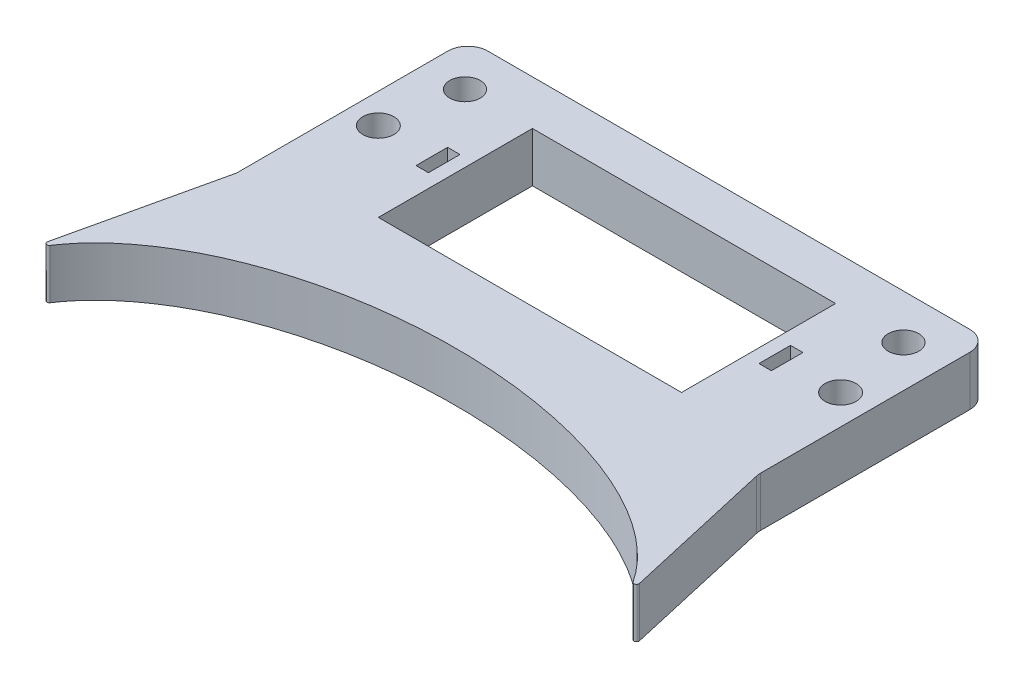
ISO-10303-21;
HEADER;
FILE_DESCRIPTION(('STEP AP214'),'2;1');
FILE_NAME('part.step','',(''),(''),'','','');
FILE_SCHEMA(('AUTOMOTIVE_DESIGN { 1 0 10303 214 1 1 1 1 }'));
ENDSEC;
DATA;
#1=APPLICATION_CONTEXT('core data for automotive mechanical design processes');
#2=APPLICATION_PROTOCOL_DEFINITION('international standard','automotive_design',2000,#1);
#3=PRODUCT_CONTEXT('',#1,'mechanical');
#4=PRODUCT('Part','Part','',(#3));
#5=PRODUCT_RELATED_PRODUCT_CATEGORY('part','',(#4));
#6=PRODUCT_DEFINITION_FORMATION('','',#4);
#7=PRODUCT_DEFINITION_CONTEXT('part definition',#1,'design');
#8=PRODUCT_DEFINITION('design','',#6,#7);
#9=PRODUCT_DEFINITION_SHAPE('','',#8);
#10=(LENGTH_UNIT() NAMED_UNIT(*) SI_UNIT(.MILLI.,.METRE.));
#11=(NAMED_UNIT(*) PLANE_ANGLE_UNIT() SI_UNIT($,.RADIAN.));
#12=(NAMED_UNIT(*) SI_UNIT($,.STERADIAN.) SOLID_ANGLE_UNIT());
#13=UNCERTAINTY_MEASURE_WITH_UNIT(LENGTH_MEASURE(1.E-05),#10,'distance_accuracy_value','');
#14=(GEOMETRIC_REPRESENTATION_CONTEXT(3) GLOBAL_UNCERTAINTY_ASSIGNED_CONTEXT((#13)) GLOBAL_UNIT_ASSIGNED_CONTEXT((#10,
#11,#12)) REPRESENTATION_CONTEXT('',''));
#15=CARTESIAN_POINT('',(0.,0.,0.));
#16=DIRECTION('',(0.,0.,1.));
#17=DIRECTION('',(1.,0.,0.));
#18=AXIS2_PLACEMENT_3D('',#15,#16,#17);
#19=CARTESIAN_POINT('',(0.,10.,0.));
#20=DIRECTION('',(0.,-1.,0.));
#21=DIRECTION('',(0.,0.,-1.));
#22=AXIS2_PLACEMENT_3D('',#19,#20,#21);
#23=PLANE('',#22);
#24=CARTESIAN_POINT('',(44.1084954751984,10.,-18.5417321671301));
#25=DIRECTION('',(0.,-1.,0.));
#26=DIRECTION('',(0.,0.,1.));
#27=AXIS2_PLACEMENT_3D('',#24,#25,#26);
#28=CIRCLE('',#27,3.075);
#29=CARTESIAN_POINT('',(44.1084954751984,10.,-15.4667321671301));
#30=VERTEX_POINT('',#29);
#31=EDGE_CURVE('E523',#30,#30,#28,.T.);
#32=ORIENTED_EDGE('',*,*,#31,.T.);
#33=EDGE_LOOP('',(#32));
#34=FACE_BOUND('',#33,.T.);
#35=CARTESIAN_POINT('',(0.,9.99999999999999,62.5));
#36=DIRECTION('',(0.,1.,0.));
#37=DIRECTION('',(-1.,0.,0.));
#38=AXIS2_PLACEMENT_3D('',#35,#36,#37);
#39=ELLIPSE('',#38,62.5,35.);
#40=CARTESIAN_POINT('',(-58.6354616926165,9.99999999999999,50.3836311782537));
#41=VERTEX_POINT('',#40);
#42=CARTESIAN_POINT('',(58.6354616926165,9.99999999999999,50.3836311782537));
#43=VERTEX_POINT('',#42);
#44=EDGE_CURVE('E254',#41,#43,#39,.F.);
#45=ORIENTED_EDGE('',*,*,#44,.T.);
#46=CARTESIAN_POINT('',(59.0529725923322,10.,50.1085227475966));
#47=DIRECTION('',(0.,-1.,0.));
#48=DIRECTION('',(0.,0.,-1.));
#49=AXIS2_PLACEMENT_3D('',#46,#47,#48);
#50=CIRCLE('',#49,0.5);
#51=CARTESIAN_POINT('',(59.5405237091368,9.99999999999999,49.997644848525));
#52=VERTEX_POINT('',#51);
#53=EDGE_CURVE('E45',#43,#52,#50,.F.);
#54=ORIENTED_EDGE('',*,*,#53,.T.);
#55=DIRECTION('',(-0.221755798143061,0.,-0.975102233609345));
#56=VECTOR('',#55,1.);
#57=CARTESIAN_POINT('',(45.8013612673687,9.99999999999999,-10.416053900614));
#58=LINE('',#57,#56);
#59=CARTESIAN_POINT('',(52.5995910655626,9.99999999999999,19.4770497580872));
#60=VERTEX_POINT('',#59);
#61=EDGE_CURVE('E237',#52,#60,#58,.T.);
#62=ORIENTED_EDGE('',*,*,#61,.T.);
#63=CARTESIAN_POINT('',(56.5,10.,18.590026565515));
#64=DIRECTION('',(0.,-1.,0.));
#65=DIRECTION('',(0.,0.,-1.));
#66=AXIS2_PLACEMENT_3D('',#63,#64,#65);
#67=CIRCLE('',#66,4.);
#68=CARTESIAN_POINT('',(52.5,10.,18.590026565515));
#69=VERTEX_POINT('',#68);
#70=EDGE_CURVE('E364',#60,#69,#67,.T.);
#71=ORIENTED_EDGE('',*,*,#70,.T.);
#72=DIRECTION('',(0.,0.,-1.));
#73=VECTOR('',#72,1.);
#74=CARTESIAN_POINT('',(52.5,10.,27.5));
#75=LINE('',#74,#73);
#76=CARTESIAN_POINT('',(52.5,10.,-23.5));
#77=VERTEX_POINT('',#76);
#78=EDGE_CURVE('E406',#69,#77,#75,.T.);
#79=ORIENTED_EDGE('',*,*,#78,.T.);
#80=CARTESIAN_POINT('',(48.5,10.,-23.5));
#81=DIRECTION('',(0.,-1.,0.));
#82=DIRECTION('',(0.,0.,-1.));
#83=AXIS2_PLACEMENT_3D('',#80,#81,#82);
#84=CIRCLE('',#83,4.);
#85=CARTESIAN_POINT('',(48.5,10.,-27.5));
#86=VERTEX_POINT('',#85);
#87=EDGE_CURVE('E373',#77,#86,#84,.F.);
#88=ORIENTED_EDGE('',*,*,#87,.T.);
#89=DIRECTION('',(-1.,0.,0.));
#90=VECTOR('',#89,1.);
#91=CARTESIAN_POINT('',(-52.5,10.,-27.5));
#92=LINE('',#91,#90);
#93=CARTESIAN_POINT('',(-48.5,10.,-27.5));
#94=VERTEX_POINT('',#93);
#95=EDGE_CURVE('E416',#86,#94,#92,.T.);
#96=ORIENTED_EDGE('',*,*,#95,.T.);
#97=CARTESIAN_POINT('',(-48.5,10.,-23.5));
#98=DIRECTION('',(0.,-1.,0.));
#99=DIRECTION('',(0.,0.,-1.));
#100=AXIS2_PLACEMENT_3D('',#97,#98,#99);
#101=CIRCLE('',#100,4.);
#102=CARTESIAN_POINT('',(-52.5,10.,-23.5));
#103=VERTEX_POINT('',#102);
#104=EDGE_CURVE('E375',#94,#103,#101,.F.);
#105=ORIENTED_EDGE('',*,*,#104,.T.);
#106=DIRECTION('',(0.,0.,1.));
#107=VECTOR('',#106,1.);
#108=CARTESIAN_POINT('',(-52.5,10.,27.5));
#109=LINE('',#108,#107);
#110=CARTESIAN_POINT('',(-52.5,10.,18.590026565515));
#111=VERTEX_POINT('',#110);
#112=EDGE_CURVE('E402',#103,#111,#109,.T.);
#113=ORIENTED_EDGE('',*,*,#112,.T.);
#114=CARTESIAN_POINT('',(-56.5,9.99999999999999,18.590026565515));
#115=DIRECTION('',(0.,-1.,0.));
#116=DIRECTION('',(0.,0.,-1.));
#117=AXIS2_PLACEMENT_3D('',#114,#115,#116);
#118=CIRCLE('',#117,4.);
#119=CARTESIAN_POINT('',(-52.5995910655626,9.99999999999999,19.4770497580872));
#120=VERTEX_POINT('',#119);
#121=EDGE_CURVE('E368',#111,#120,#118,.T.);
#122=ORIENTED_EDGE('',*,*,#121,.T.);
#123=DIRECTION('',(0.221755798143061,0.,-0.975102233609345));
#124=VECTOR('',#123,1.);
#125=CARTESIAN_POINT('',(-45.8013612673687,9.99999999999999,-10.416053900614));
#126=LINE('',#125,#124);
#127=CARTESIAN_POINT('',(-59.5405237091368,9.99999999999999,49.997644848525));
#128=VERTEX_POINT('',#127);
#129=EDGE_CURVE('E257',#128,#120,#126,.T.);
#130=ORIENTED_EDGE('',*,*,#129,.F.);
#131=CARTESIAN_POINT('',(-59.0529725923321,10.,50.1085227475966));
#132=DIRECTION('',(0.,-1.,0.));
#133=DIRECTION('',(0.,0.,-1.));
#134=AXIS2_PLACEMENT_3D('',#131,#132,#133);
#135=CIRCLE('',#134,0.5);
#136=EDGE_CURVE('E352',#128,#41,#135,.F.);
#137=ORIENTED_EDGE('',*,*,#136,.T.);
#138=EDGE_LOOP('',(#45,#54,#62,#71,#79,#88,#96,#105,#113,#122,#130,#137));
#139=FACE_BOUND('',#138,.T.);
#140=CARTESIAN_POINT('',(46.5,10.,-3.5));
#141=DIRECTION('',(0.,-1.,0.));
#142=DIRECTION('',(0.,0.,1.));
#143=AXIS2_PLACEMENT_3D('',#140,#141,#142);
#144=CIRCLE('',#143,3.125);
#145=CARTESIAN_POINT('',(46.5,10.,-0.375000000000004));
#146=VERTEX_POINT('',#145);
#147=EDGE_CURVE('E230',#146,#146,#144,.T.);
#148=ORIENTED_EDGE('',*,*,#147,.T.);
#149=EDGE_LOOP('',(#148));
#150=FACE_BOUND('',#149,.T.);
#151=DIRECTION('',(0.,0.,1.));
#152=VECTOR('',#151,1.);
#153=CARTESIAN_POINT('',(35.75,10.,-6.67500000000001));
#154=LINE('',#153,#152);
#155=CARTESIAN_POINT('',(35.75,10.,-6.67500000000001));
#156=VERTEX_POINT('',#155);
#157=CARTESIAN_POINT('',(35.75,10.,-0.325000000000004));
#158=VERTEX_POINT('',#157);
#159=EDGE_CURVE('E218',#156,#158,#154,.T.);
#160=ORIENTED_EDGE('',*,*,#159,.T.);
#161=DIRECTION('',(-1.,0.,0.));
#162=VECTOR('',#161,1.);
#163=CARTESIAN_POINT('',(33.25,10.,-0.325000000000004));
#164=LINE('',#163,#162);
#165=CARTESIAN_POINT('',(33.25,10.,-0.325000000000004));
#166=VERTEX_POINT('',#165);
#167=EDGE_CURVE('E224',#158,#166,#164,.T.);
#168=ORIENTED_EDGE('',*,*,#167,.T.);
#169=DIRECTION('',(0.,0.,-1.));
#170=VECTOR('',#169,1.);
#171=CARTESIAN_POINT('',(33.25,10.,-6.67500000000001));
#172=LINE('',#171,#170);
#173=CARTESIAN_POINT('',(33.25,10.,-6.67500000000001));
#174=VERTEX_POINT('',#173);
#175=EDGE_CURVE('E227',#166,#174,#172,.T.);
#176=ORIENTED_EDGE('',*,*,#175,.T.);
#177=DIRECTION('',(1.,0.,0.));
#178=VECTOR('',#177,1.);
#179=CARTESIAN_POINT('',(33.25,10.,-6.67500000000001));
#180=LINE('',#179,#178);
#181=EDGE_CURVE('E236',#174,#156,#180,.T.);
#182=ORIENTED_EDGE('',*,*,#181,.T.);
#183=EDGE_LOOP('',(#160,#168,#176,#182));
#184=FACE_BOUND('',#183,.T.);
#185=CARTESIAN_POINT('',(-44.1084954751984,10.,-18.5417321671301));
#186=DIRECTION('',(0.,1.,0.));
#187=DIRECTION('',(0.,0.,1.));
#188=AXIS2_PLACEMENT_3D('',#185,#186,#187);
#189=CIRCLE('',#188,3.075);
#190=CARTESIAN_POINT('',(-44.1084954751984,10.,-15.4667321671301));
#191=VERTEX_POINT('',#190);
#192=EDGE_CURVE('E250',#191,#191,#189,.T.);
#193=ORIENTED_EDGE('',*,*,#192,.F.);
#194=EDGE_LOOP('',(#193));
#195=FACE_BOUND('',#194,.T.);
#196=CARTESIAN_POINT('',(-46.5,10.,-3.5));
#197=DIRECTION('',(0.,1.,0.));
#198=DIRECTION('',(0.,0.,1.));
#199=AXIS2_PLACEMENT_3D('',#196,#197,#198);
#200=CIRCLE('',#199,3.125);
#201=CARTESIAN_POINT('',(-46.5,10.,-0.375000000000004));
#202=VERTEX_POINT('',#201);
#203=EDGE_CURVE('E463',#202,#202,#200,.T.);
#204=ORIENTED_EDGE('',*,*,#203,.F.);
#205=EDGE_LOOP('',(#204));
#206=FACE_BOUND('',#205,.T.);
#207=DIRECTION('',(1.,0.,0.));
#208=VECTOR('',#207,1.);
#209=CARTESIAN_POINT('',(-33.25,10.,-0.325000000000004));
#210=LINE('',#209,#208);
#211=CARTESIAN_POINT('',(-35.75,10.,-0.325000000000004));
#212=VERTEX_POINT('',#211);
#213=CARTESIAN_POINT('',(-33.25,10.,-0.325000000000004));
#214=VERTEX_POINT('',#213);
#215=EDGE_CURVE('E471',#212,#214,#210,.T.);
#216=ORIENTED_EDGE('',*,*,#215,.F.);
#217=DIRECTION('',(0.,0.,1.));
#218=VECTOR('',#217,1.);
#219=CARTESIAN_POINT('',(-35.75,10.,-6.67500000000001));
#220=LINE('',#219,#218);
#221=CARTESIAN_POINT('',(-35.75,10.,-6.67500000000001));
#222=VERTEX_POINT('',#221);
#223=EDGE_CURVE('E256',#222,#212,#220,.T.);
#224=ORIENTED_EDGE('',*,*,#223,.F.);
#225=DIRECTION('',(-1.,0.,0.));
#226=VECTOR('',#225,1.);
#227=CARTESIAN_POINT('',(-33.25,10.,-6.67500000000001));
#228=LINE('',#227,#226);
#229=CARTESIAN_POINT('',(-33.25,10.,-6.67500000000001));
#230=VERTEX_POINT('',#229);
#231=EDGE_CURVE('E464',#230,#222,#228,.T.);
#232=ORIENTED_EDGE('',*,*,#231,.F.);
#233=DIRECTION('',(0.,0.,-1.));
#234=VECTOR('',#233,1.);
#235=CARTESIAN_POINT('',(-33.25,10.,-6.67500000000001));
#236=LINE('',#235,#234);
#237=EDGE_CURVE('E468',#214,#230,#236,.T.);
#238=ORIENTED_EDGE('',*,*,#237,.F.);
#239=EDGE_LOOP('',(#216,#224,#232,#238));
#240=FACE_BOUND('',#239,.T.);
#241=DIRECTION('',(-1.,0.,0.));
#242=VECTOR('',#241,1.);
#243=CARTESIAN_POINT('',(-30.5,10.,-18.5));
#244=LINE('',#243,#242);
#245=CARTESIAN_POINT('',(30.5,10.,-18.5));
#246=VERTEX_POINT('',#245);
#247=CARTESIAN_POINT('',(-30.5,10.,-18.5));
#248=VERTEX_POINT('',#247);
#249=EDGE_CURVE('E437',#246,#248,#244,.T.);
#250=ORIENTED_EDGE('',*,*,#249,.F.);
#251=DIRECTION('',(0.,0.,-1.));
#252=VECTOR('',#251,1.);
#253=CARTESIAN_POINT('',(30.5,10.,-18.5));
#254=LINE('',#253,#252);
#255=CARTESIAN_POINT('',(30.5,10.,12.5));
#256=VERTEX_POINT('',#255);
#257=EDGE_CURVE('E440',#256,#246,#254,.T.);
#258=ORIENTED_EDGE('',*,*,#257,.F.);
#259=DIRECTION('',(1.,0.,0.));
#260=VECTOR('',#259,1.);
#261=CARTESIAN_POINT('',(-30.5,10.,12.5));
#262=LINE('',#261,#260);
#263=CARTESIAN_POINT('',(-30.5,10.,12.5));
#264=VERTEX_POINT('',#263);
#265=EDGE_CURVE('E430',#264,#256,#262,.T.);
#266=ORIENTED_EDGE('',*,*,#265,.F.);
#267=DIRECTION('',(0.,0.,1.));
#268=VECTOR('',#267,1.);
#269=CARTESIAN_POINT('',(-30.5,10.,-18.5));
#270=LINE('',#269,#268);
#271=EDGE_CURVE('E434',#248,#264,#270,.T.);
#272=ORIENTED_EDGE('',*,*,#271,.F.);
#273=EDGE_LOOP('',(#250,#258,#266,#272));
#274=FACE_BOUND('',#273,.T.);
#275=ADVANCED_FACE('F37',(#34,#139,#150,#184,#195,#206,#240,#274),#23,.F.);
#276=CARTESIAN_POINT('',(0.,0.,0.));
#277=DIRECTION('',(0.,-1.,0.));
#278=DIRECTION('',(0.,0.,-1.));
#279=AXIS2_PLACEMENT_3D('',#276,#277,#278);
#280=PLANE('',#279);
#281=CARTESIAN_POINT('',(44.1084954751984,0.,-18.5417321671301));
#282=DIRECTION('',(0.,-1.,0.));
#283=DIRECTION('',(0.,0.,1.));
#284=AXIS2_PLACEMENT_3D('',#281,#282,#283);
#285=CIRCLE('',#284,3.075);
#286=CARTESIAN_POINT('',(44.1084954751984,0.,-15.4667321671301));
#287=VERTEX_POINT('',#286);
#288=EDGE_CURVE('E519',#287,#287,#285,.T.);
#289=ORIENTED_EDGE('',*,*,#288,.F.);
#290=EDGE_LOOP('',(#289));
#291=FACE_BOUND('',#290,.T.);
#292=DIRECTION('',(0.221755798143061,0.,0.975102233609345));
#293=VECTOR('',#292,1.);
#294=CARTESIAN_POINT('',(45.8013612673687,0.,-10.416053900614));
#295=LINE('',#294,#293);
#296=CARTESIAN_POINT('',(52.5995910655626,0.,19.4770497580872));
#297=VERTEX_POINT('',#296);
#298=CARTESIAN_POINT('',(59.5405237091368,0.,49.9976448485251));
#299=VERTEX_POINT('',#298);
#300=EDGE_CURVE('E516',#297,#299,#295,.T.);
#301=ORIENTED_EDGE('',*,*,#300,.T.);
#302=CARTESIAN_POINT('',(59.0529725923322,0.,50.1085227475966));
#303=DIRECTION('',(0.,-1.,0.));
#304=DIRECTION('',(0.,0.,-1.));
#305=AXIS2_PLACEMENT_3D('',#302,#303,#304);
#306=CIRCLE('',#305,0.5);
#307=CARTESIAN_POINT('',(58.6354616926165,0.,50.3836311782537));
#308=VERTEX_POINT('',#307);
#309=EDGE_CURVE('E359',#299,#308,#306,.T.);
#310=ORIENTED_EDGE('',*,*,#309,.T.);
#311=CARTESIAN_POINT('',(0.,0.,62.5));
#312=DIRECTION('',(0.,1.,0.));
#313=DIRECTION('',(-1.,0.,0.));
#314=AXIS2_PLACEMENT_3D('',#311,#312,#313);
#315=ELLIPSE('',#314,62.5,35.);
#316=CARTESIAN_POINT('',(-58.6354616926165,0.,50.3836311782537));
#317=VERTEX_POINT('',#316);
#318=EDGE_CURVE('E249',#308,#317,#315,.T.);
#319=ORIENTED_EDGE('',*,*,#318,.T.);
#320=CARTESIAN_POINT('',(-59.0529725923321,0.,50.1085227475966));
#321=DIRECTION('',(0.,-1.,0.));
#322=DIRECTION('',(0.,0.,-1.));
#323=AXIS2_PLACEMENT_3D('',#320,#321,#322);
#324=CIRCLE('',#323,0.5);
#325=CARTESIAN_POINT('',(-59.5405237091368,0.,49.997644848525));
#326=VERTEX_POINT('',#325);
#327=EDGE_CURVE('E361',#317,#326,#324,.T.);
#328=ORIENTED_EDGE('',*,*,#327,.T.);
#329=DIRECTION('',(-0.221755798143061,0.,0.975102233609345));
#330=VECTOR('',#329,1.);
#331=CARTESIAN_POINT('',(-45.8013612673687,0.,-10.416053900614));
#332=LINE('',#331,#330);
#333=CARTESIAN_POINT('',(-52.5995910655626,0.,19.4770497580872));
#334=VERTEX_POINT('',#333);
#335=EDGE_CURVE('E489',#334,#326,#332,.T.);
#336=ORIENTED_EDGE('',*,*,#335,.F.);
#337=CARTESIAN_POINT('',(-56.5,0.,18.590026565515));
#338=DIRECTION('',(0.,-1.,0.));
#339=DIRECTION('',(0.,0.,-1.));
#340=AXIS2_PLACEMENT_3D('',#337,#338,#339);
#341=CIRCLE('',#340,4.);
#342=CARTESIAN_POINT('',(-52.5,0.,18.590026565515));
#343=VERTEX_POINT('',#342);
#344=EDGE_CURVE('E371',#334,#343,#341,.F.);
#345=ORIENTED_EDGE('',*,*,#344,.T.);
#346=DIRECTION('',(0.,0.,1.));
#347=VECTOR('',#346,1.);
#348=CARTESIAN_POINT('',(-52.5,0.,27.5));
#349=LINE('',#348,#347);
#350=CARTESIAN_POINT('',(-52.5,0.,-23.5));
#351=VERTEX_POINT('',#350);
#352=EDGE_CURVE('E403',#351,#343,#349,.T.);
#353=ORIENTED_EDGE('',*,*,#352,.F.);
#354=CARTESIAN_POINT('',(-48.5,0.,-23.5));
#355=DIRECTION('',(0.,-1.,0.));
#356=DIRECTION('',(0.,0.,-1.));
#357=AXIS2_PLACEMENT_3D('',#354,#355,#356);
#358=CIRCLE('',#357,4.);
#359=CARTESIAN_POINT('',(-48.5,0.,-27.5));
#360=VERTEX_POINT('',#359);
#361=EDGE_CURVE('E379',#351,#360,#358,.T.);
#362=ORIENTED_EDGE('',*,*,#361,.T.);
#363=DIRECTION('',(-1.,0.,0.));
#364=VECTOR('',#363,1.);
#365=CARTESIAN_POINT('',(-52.5,0.,-27.5));
#366=LINE('',#365,#364);
#367=CARTESIAN_POINT('',(48.5,0.,-27.5));
#368=VERTEX_POINT('',#367);
#369=EDGE_CURVE('E407',#368,#360,#366,.T.);
#370=ORIENTED_EDGE('',*,*,#369,.F.);
#371=CARTESIAN_POINT('',(48.5,0.,-23.5));
#372=DIRECTION('',(0.,-1.,0.));
#373=DIRECTION('',(0.,0.,-1.));
#374=AXIS2_PLACEMENT_3D('',#371,#372,#373);
#375=CIRCLE('',#374,4.);
#376=CARTESIAN_POINT('',(52.5,0.,-23.5));
#377=VERTEX_POINT('',#376);
#378=EDGE_CURVE('E377',#368,#377,#375,.T.);
#379=ORIENTED_EDGE('',*,*,#378,.T.);
#380=DIRECTION('',(0.,0.,-1.));
#381=VECTOR('',#380,1.);
#382=CARTESIAN_POINT('',(52.5,0.,27.5));
#383=LINE('',#382,#381);
#384=CARTESIAN_POINT('',(52.5,0.,18.590026565515));
#385=VERTEX_POINT('',#384);
#386=EDGE_CURVE('E410',#385,#377,#383,.T.);
#387=ORIENTED_EDGE('',*,*,#386,.F.);
#388=CARTESIAN_POINT('',(56.5,0.,18.590026565515));
#389=DIRECTION('',(0.,-1.,0.));
#390=DIRECTION('',(0.,0.,-1.));
#391=AXIS2_PLACEMENT_3D('',#388,#389,#390);
#392=CIRCLE('',#391,4.);
#393=EDGE_CURVE('E366',#385,#297,#392,.F.);
#394=ORIENTED_EDGE('',*,*,#393,.T.);
#395=EDGE_LOOP('',(#301,#310,#319,#328,#336,#345,#353,#362,#370,#379,#387,#394));
#396=FACE_BOUND('',#395,.T.);
#397=DIRECTION('',(-1.,0.,0.));
#398=VECTOR('',#397,1.);
#399=CARTESIAN_POINT('',(33.25,0.,-0.325000000000004));
#400=LINE('',#399,#398);
#401=CARTESIAN_POINT('',(35.75,0.,-0.325000000000004));
#402=VERTEX_POINT('',#401);
#403=CARTESIAN_POINT('',(33.25,0.,-0.325000000000004));
#404=VERTEX_POINT('',#403);
#405=EDGE_CURVE('E219',#402,#404,#400,.T.);
#406=ORIENTED_EDGE('',*,*,#405,.F.);
#407=DIRECTION('',(0.,0.,1.));
#408=VECTOR('',#407,1.);
#409=CARTESIAN_POINT('',(35.75,0.,-6.67500000000001));
#410=LINE('',#409,#408);
#411=CARTESIAN_POINT('',(35.75,0.,-6.67500000000001));
#412=VERTEX_POINT('',#411);
#413=EDGE_CURVE('E211',#412,#402,#410,.T.);
#414=ORIENTED_EDGE('',*,*,#413,.F.);
#415=DIRECTION('',(1.,0.,0.));
#416=VECTOR('',#415,1.);
#417=CARTESIAN_POINT('',(33.25,0.,-6.67500000000001));
#418=LINE('',#417,#416);
#419=CARTESIAN_POINT('',(33.25,0.,-6.67500000000001));
#420=VERTEX_POINT('',#419);
#421=EDGE_CURVE('E199',#420,#412,#418,.T.);
#422=ORIENTED_EDGE('',*,*,#421,.F.);
#423=DIRECTION('',(0.,0.,-1.));
#424=VECTOR('',#423,1.);
#425=CARTESIAN_POINT('',(33.25,0.,-6.67500000000001));
#426=LINE('',#425,#424);
#427=EDGE_CURVE('E210',#404,#420,#426,.T.);
#428=ORIENTED_EDGE('',*,*,#427,.F.);
#429=EDGE_LOOP('',(#406,#414,#422,#428));
#430=FACE_BOUND('',#429,.T.);
#431=CARTESIAN_POINT('',(-46.5,0.,-3.5));
#432=DIRECTION('',(0.,1.,0.));
#433=DIRECTION('',(0.,0.,1.));
#434=AXIS2_PLACEMENT_3D('',#431,#432,#433);
#435=CIRCLE('',#434,3.125);
#436=CARTESIAN_POINT('',(-46.5,0.,-0.375000000000004));
#437=VERTEX_POINT('',#436);
#438=EDGE_CURVE('E442',#437,#437,#435,.T.);
#439=ORIENTED_EDGE('',*,*,#438,.T.);
#440=EDGE_LOOP('',(#439));
#441=FACE_BOUND('',#440,.T.);
#442=DIRECTION('',(0.,0.,1.));
#443=VECTOR('',#442,1.);
#444=CARTESIAN_POINT('',(-35.75,0.,-6.67500000000001));
#445=LINE('',#444,#443);
#446=CARTESIAN_POINT('',(-35.75,0.,-6.67500000000001));
#447=VERTEX_POINT('',#446);
#448=CARTESIAN_POINT('',(-35.75,0.,-0.325000000000004));
#449=VERTEX_POINT('',#448);
#450=EDGE_CURVE('E467',#447,#449,#445,.T.);
#451=ORIENTED_EDGE('',*,*,#450,.T.);
#452=DIRECTION('',(1.,0.,0.));
#453=VECTOR('',#452,1.);
#454=CARTESIAN_POINT('',(-33.25,0.,-0.325000000000004));
#455=LINE('',#454,#453);
#456=CARTESIAN_POINT('',(-33.25,0.,-0.325000000000004));
#457=VERTEX_POINT('',#456);
#458=EDGE_CURVE('E480',#449,#457,#455,.T.);
#459=ORIENTED_EDGE('',*,*,#458,.T.);
#460=DIRECTION('',(0.,0.,-1.));
#461=VECTOR('',#460,1.);
#462=CARTESIAN_POINT('',(-33.25,0.,-6.67500000000001));
#463=LINE('',#462,#461);
#464=CARTESIAN_POINT('',(-33.25,0.,-6.67500000000001));
#465=VERTEX_POINT('',#464);
#466=EDGE_CURVE('E477',#457,#465,#463,.T.);
#467=ORIENTED_EDGE('',*,*,#466,.T.);
#468=DIRECTION('',(-1.,0.,0.));
#469=VECTOR('',#468,1.);
#470=CARTESIAN_POINT('',(-33.25,0.,-6.67500000000001));
#471=LINE('',#470,#469);
#472=EDGE_CURVE('E457',#465,#447,#471,.T.);
#473=ORIENTED_EDGE('',*,*,#472,.T.);
#474=EDGE_LOOP('',(#451,#459,#467,#473));
#475=FACE_BOUND('',#474,.T.);
#476=DIRECTION('',(0.,0.,-1.));
#477=VECTOR('',#476,1.);
#478=CARTESIAN_POINT('',(30.5,0.,-18.5));
#479=LINE('',#478,#477);
#480=CARTESIAN_POINT('',(30.5,0.,12.5));
#481=VERTEX_POINT('',#480);
#482=CARTESIAN_POINT('',(30.5,0.,-18.5));
#483=VERTEX_POINT('',#482);
#484=EDGE_CURVE('E433',#481,#483,#479,.T.);
#485=ORIENTED_EDGE('',*,*,#484,.T.);
#486=DIRECTION('',(-1.,0.,0.));
#487=VECTOR('',#486,1.);
#488=CARTESIAN_POINT('',(-30.5,0.,-18.5));
#489=LINE('',#488,#487);
#490=CARTESIAN_POINT('',(-30.5,0.,-18.5));
#491=VERTEX_POINT('',#490);
#492=EDGE_CURVE('E448',#483,#491,#489,.T.);
#493=ORIENTED_EDGE('',*,*,#492,.T.);
#494=DIRECTION('',(0.,0.,1.));
#495=VECTOR('',#494,1.);
#496=CARTESIAN_POINT('',(-30.5,0.,-18.5));
#497=LINE('',#496,#495);
#498=CARTESIAN_POINT('',(-30.5,0.,12.5));
#499=VERTEX_POINT('',#498);
#500=EDGE_CURVE('E445',#491,#499,#497,.T.);
#501=ORIENTED_EDGE('',*,*,#500,.T.);
#502=DIRECTION('',(1.,0.,0.));
#503=VECTOR('',#502,1.);
#504=CARTESIAN_POINT('',(-30.5,0.,12.5));
#505=LINE('',#504,#503);
#506=EDGE_CURVE('E425',#499,#481,#505,.T.);
#507=ORIENTED_EDGE('',*,*,#506,.T.);
#508=EDGE_LOOP('',(#485,#493,#501,#507));
#509=FACE_BOUND('',#508,.T.);
#510=CARTESIAN_POINT('',(-44.1084954751984,0.,-18.5417321671301));
#511=DIRECTION('',(0.,1.,0.));
#512=DIRECTION('',(0.,0.,1.));
#513=AXIS2_PLACEMENT_3D('',#510,#511,#512);
#514=CIRCLE('',#513,3.075);
#515=CARTESIAN_POINT('',(-44.1084954751984,0.,-15.4667321671301));
#516=VERTEX_POINT('',#515);
#517=EDGE_CURVE('E246',#516,#516,#514,.T.);
#518=ORIENTED_EDGE('',*,*,#517,.T.);
#519=EDGE_LOOP('',(#518));
#520=FACE_BOUND('',#519,.T.);
#521=CARTESIAN_POINT('',(46.5,0.,-3.5));
#522=DIRECTION('',(0.,-1.,0.));
#523=DIRECTION('',(0.,0.,1.));
#524=AXIS2_PLACEMENT_3D('',#521,#522,#523);
#525=CIRCLE('',#524,3.125);
#526=CARTESIAN_POINT('',(46.5,0.,-0.375000000000004));
#527=VERTEX_POINT('',#526);
#528=EDGE_CURVE('E253',#527,#527,#525,.T.);
#529=ORIENTED_EDGE('',*,*,#528,.F.);
#530=EDGE_LOOP('',(#529));
#531=FACE_BOUND('',#530,.T.);
#532=ADVANCED_FACE('F222',(#291,#396,#430,#441,#475,#509,#520,#531),#280,.T.);
#533=CARTESIAN_POINT('',(52.5,10.,27.5));
#534=DIRECTION('',(-1.,0.,0.));
#535=DIRECTION('',(0.,0.,1.));
#536=AXIS2_PLACEMENT_3D('',#533,#534,#535);
#537=PLANE('',#536);
#538=ORIENTED_EDGE('',*,*,#78,.F.);
#539=DIRECTION('',(0.,-1.,0.));
#540=VECTOR('',#539,1.);
#541=CARTESIAN_POINT('',(52.5,10.,18.590026565515));
#542=LINE('',#541,#540);
#543=EDGE_CURVE('E389',#69,#385,#542,.T.);
#544=ORIENTED_EDGE('',*,*,#543,.T.);
#545=ORIENTED_EDGE('',*,*,#386,.T.);
#546=DIRECTION('',(0.,-1.,0.));
#547=VECTOR('',#546,1.);
#548=CARTESIAN_POINT('',(52.5,10.,-23.5));
#549=LINE('',#548,#547);
#550=EDGE_CURVE('E392',#377,#77,#549,.F.);
#551=ORIENTED_EDGE('',*,*,#550,.T.);
#552=EDGE_LOOP('',(#538,#544,#545,#551));
#553=FACE_BOUND('',#552,.T.);
#554=ADVANCED_FACE('F311',(#553),#537,.F.);
#555=CARTESIAN_POINT('',(-52.5,10.,-27.5));
#556=DIRECTION('',(0.,0.,1.));
#557=DIRECTION('',(1.,0.,0.));
#558=AXIS2_PLACEMENT_3D('',#555,#556,#557);
#559=PLANE('',#558);
#560=ORIENTED_EDGE('',*,*,#95,.F.);
#561=DIRECTION('',(0.,-1.,0.));
#562=VECTOR('',#561,1.);
#563=CARTESIAN_POINT('',(48.5,10.,-27.5));
#564=LINE('',#563,#562);
#565=EDGE_CURVE('E381',#86,#368,#564,.T.);
#566=ORIENTED_EDGE('',*,*,#565,.T.);
#567=ORIENTED_EDGE('',*,*,#369,.T.);
#568=DIRECTION('',(0.,-1.,0.));
#569=VECTOR('',#568,1.);
#570=CARTESIAN_POINT('',(-48.5,10.,-27.5));
#571=LINE('',#570,#569);
#572=EDGE_CURVE('E384',#360,#94,#571,.F.);
#573=ORIENTED_EDGE('',*,*,#572,.T.);
#574=EDGE_LOOP('',(#560,#566,#567,#573));
#575=FACE_BOUND('',#574,.T.);
#576=ADVANCED_FACE('F315',(#575),#559,.F.);
#577=CARTESIAN_POINT('',(-52.5,10.,27.5));
#578=DIRECTION('',(1.,0.,0.));
#579=DIRECTION('',(0.,0.,-1.));
#580=AXIS2_PLACEMENT_3D('',#577,#578,#579);
#581=PLANE('',#580);
#582=ORIENTED_EDGE('',*,*,#352,.T.);
#583=DIRECTION('',(0.,-1.,0.));
#584=VECTOR('',#583,1.);
#585=CARTESIAN_POINT('',(-52.5,10.,18.590026565515));
#586=LINE('',#585,#584);
#587=EDGE_CURVE('E394',#343,#111,#586,.F.);
#588=ORIENTED_EDGE('',*,*,#587,.T.);
#589=ORIENTED_EDGE('',*,*,#112,.F.);
#590=DIRECTION('',(0.,-1.,0.));
#591=VECTOR('',#590,1.);
#592=CARTESIAN_POINT('',(-52.5,10.,-23.5));
#593=LINE('',#592,#591);
#594=EDGE_CURVE('E396',#103,#351,#593,.T.);
#595=ORIENTED_EDGE('',*,*,#594,.T.);
#596=EDGE_LOOP('',(#582,#588,#589,#595));
#597=FACE_BOUND('',#596,.T.);
#598=ADVANCED_FACE('F304',(#597),#581,.F.);
#599=CARTESIAN_POINT('',(30.5,0.,-18.5));
#600=DIRECTION('',(1.,0.,0.));
#601=DIRECTION('',(0.,0.,-1.));
#602=AXIS2_PLACEMENT_3D('',#599,#600,#601);
#603=PLANE('',#602);
#604=ORIENTED_EDGE('',*,*,#257,.T.);
#605=DIRECTION('',(0.,1.,0.));
#606=VECTOR('',#605,1.);
#607=CARTESIAN_POINT('',(30.5,0.,-18.5));
#608=LINE('',#607,#606);
#609=EDGE_CURVE('E421',#483,#246,#608,.T.);
#610=ORIENTED_EDGE('',*,*,#609,.F.);
#611=ORIENTED_EDGE('',*,*,#484,.F.);
#612=DIRECTION('',(0.,1.,0.));
#613=VECTOR('',#612,1.);
#614=CARTESIAN_POINT('',(30.5,0.,12.5));
#615=LINE('',#614,#613);
#616=EDGE_CURVE('E413',#481,#256,#615,.T.);
#617=ORIENTED_EDGE('',*,*,#616,.T.);
#618=EDGE_LOOP('',(#604,#610,#611,#617));
#619=FACE_BOUND('',#618,.T.);
#620=ADVANCED_FACE('F294',(#619),#603,.F.);
#621=CARTESIAN_POINT('',(-30.5,0.,12.5));
#622=DIRECTION('',(0.,0.,1.));
#623=DIRECTION('',(1.,0.,0.));
#624=AXIS2_PLACEMENT_3D('',#621,#622,#623);
#625=PLANE('',#624);
#626=ORIENTED_EDGE('',*,*,#265,.T.);
#627=ORIENTED_EDGE('',*,*,#616,.F.);
#628=ORIENTED_EDGE('',*,*,#506,.F.);
#629=DIRECTION('',(0.,1.,0.));
#630=VECTOR('',#629,1.);
#631=CARTESIAN_POINT('',(-30.5,0.,12.5));
#632=LINE('',#631,#630);
#633=EDGE_CURVE('E427',#499,#264,#632,.T.);
#634=ORIENTED_EDGE('',*,*,#633,.T.);
#635=EDGE_LOOP('',(#626,#627,#628,#634));
#636=FACE_BOUND('',#635,.T.);
#637=ADVANCED_FACE('F290',(#636),#625,.F.);
#638=CARTESIAN_POINT('',(-30.5,0.,-18.5));
#639=DIRECTION('',(-1.,0.,0.));
#640=DIRECTION('',(0.,0.,1.));
#641=AXIS2_PLACEMENT_3D('',#638,#639,#640);
#642=PLANE('',#641);
#643=ORIENTED_EDGE('',*,*,#271,.T.);
#644=ORIENTED_EDGE('',*,*,#633,.F.);
#645=ORIENTED_EDGE('',*,*,#500,.F.);
#646=DIRECTION('',(0.,1.,0.));
#647=VECTOR('',#646,1.);
#648=CARTESIAN_POINT('',(-30.5,0.,-18.5));
#649=LINE('',#648,#647);
#650=EDGE_CURVE('E424',#491,#248,#649,.T.);
#651=ORIENTED_EDGE('',*,*,#650,.T.);
#652=EDGE_LOOP('',(#643,#644,#645,#651));
#653=FACE_BOUND('',#652,.T.);
#654=ADVANCED_FACE('F293',(#653),#642,.F.);
#655=CARTESIAN_POINT('',(-30.5,0.,-18.5));
#656=DIRECTION('',(0.,0.,-1.));
#657=DIRECTION('',(-1.,0.,0.));
#658=AXIS2_PLACEMENT_3D('',#655,#656,#657);
#659=PLANE('',#658);
#660=ORIENTED_EDGE('',*,*,#249,.T.);
#661=ORIENTED_EDGE('',*,*,#650,.F.);
#662=ORIENTED_EDGE('',*,*,#492,.F.);
#663=ORIENTED_EDGE('',*,*,#609,.T.);
#664=EDGE_LOOP('',(#660,#661,#662,#663));
#665=FACE_BOUND('',#664,.T.);
#666=ADVANCED_FACE('F288',(#665),#659,.F.);
#667=CARTESIAN_POINT('',(-35.75,0.,-6.67500000000001));
#668=DIRECTION('',(-1.,0.,0.));
#669=DIRECTION('',(0.,0.,1.));
#670=AXIS2_PLACEMENT_3D('',#667,#668,#669);
#671=PLANE('',#670);
#672=ORIENTED_EDGE('',*,*,#223,.T.);
#673=DIRECTION('',(0.,1.,0.));
#674=VECTOR('',#673,1.);
#675=CARTESIAN_POINT('',(-35.75,0.,-0.325000000000004));
#676=LINE('',#675,#674);
#677=EDGE_CURVE('E453',#449,#212,#676,.T.);
#678=ORIENTED_EDGE('',*,*,#677,.F.);
#679=ORIENTED_EDGE('',*,*,#450,.F.);
#680=DIRECTION('',(0.,1.,0.));
#681=VECTOR('',#680,1.);
#682=CARTESIAN_POINT('',(-35.75,0.,-6.67500000000001));
#683=LINE('',#682,#681);
#684=EDGE_CURVE('E461',#447,#222,#683,.T.);
#685=ORIENTED_EDGE('',*,*,#684,.T.);
#686=EDGE_LOOP('',(#672,#678,#679,#685));
#687=FACE_BOUND('',#686,.T.);
#688=ADVANCED_FACE('F278',(#687),#671,.F.);
#689=CARTESIAN_POINT('',(-33.25,0.,-6.67500000000001));
#690=DIRECTION('',(0.,0.,-1.));
#691=DIRECTION('',(-1.,0.,0.));
#692=AXIS2_PLACEMENT_3D('',#689,#690,#691);
#693=PLANE('',#692);
#694=ORIENTED_EDGE('',*,*,#231,.T.);
#695=ORIENTED_EDGE('',*,*,#684,.F.);
#696=ORIENTED_EDGE('',*,*,#472,.F.);
#697=DIRECTION('',(0.,1.,0.));
#698=VECTOR('',#697,1.);
#699=CARTESIAN_POINT('',(-33.25,0.,-6.67500000000001));
#700=LINE('',#699,#698);
#701=EDGE_CURVE('E459',#465,#230,#700,.T.);
#702=ORIENTED_EDGE('',*,*,#701,.T.);
#703=EDGE_LOOP('',(#694,#695,#696,#702));
#704=FACE_BOUND('',#703,.T.);
#705=ADVANCED_FACE('F274',(#704),#693,.F.);
#706=CARTESIAN_POINT('',(-33.25,0.,-6.67500000000001));
#707=DIRECTION('',(1.,0.,0.));
#708=DIRECTION('',(0.,0.,-1.));
#709=AXIS2_PLACEMENT_3D('',#706,#707,#708);
#710=PLANE('',#709);
#711=ORIENTED_EDGE('',*,*,#237,.T.);
#712=ORIENTED_EDGE('',*,*,#701,.F.);
#713=ORIENTED_EDGE('',*,*,#466,.F.);
#714=DIRECTION('',(0.,1.,0.));
#715=VECTOR('',#714,1.);
#716=CARTESIAN_POINT('',(-33.25,0.,-0.325000000000004));
#717=LINE('',#716,#715);
#718=EDGE_CURVE('E456',#457,#214,#717,.T.);
#719=ORIENTED_EDGE('',*,*,#718,.T.);
#720=EDGE_LOOP('',(#711,#712,#713,#719));
#721=FACE_BOUND('',#720,.T.);
#722=ADVANCED_FACE('F277',(#721),#710,.F.);
#723=CARTESIAN_POINT('',(-33.25,0.,-0.325000000000004));
#724=DIRECTION('',(0.,0.,1.));
#725=DIRECTION('',(1.,0.,0.));
#726=AXIS2_PLACEMENT_3D('',#723,#724,#725);
#727=PLANE('',#726);
#728=ORIENTED_EDGE('',*,*,#215,.T.);
#729=ORIENTED_EDGE('',*,*,#718,.F.);
#730=ORIENTED_EDGE('',*,*,#458,.F.);
#731=ORIENTED_EDGE('',*,*,#677,.T.);
#732=EDGE_LOOP('',(#728,#729,#730,#731));
#733=FACE_BOUND('',#732,.T.);
#734=ADVANCED_FACE('F272',(#733),#727,.F.);
#735=CARTESIAN_POINT('',(-46.5,0.,-3.5));
#736=DIRECTION('',(0.,1.,0.));
#737=DIRECTION('',(0.,0.,1.));
#738=AXIS2_PLACEMENT_3D('',#735,#736,#737);
#739=CYLINDRICAL_SURFACE('',#738,3.125);
#740=ORIENTED_EDGE('',*,*,#438,.F.);
#741=EDGE_LOOP('',(#740));
#742=FACE_BOUND('',#741,.T.);
#743=ORIENTED_EDGE('',*,*,#203,.T.);
#744=EDGE_LOOP('',(#743));
#745=FACE_BOUND('',#744,.T.);
#746=ADVANCED_FACE('F269',(#742,#745),#739,.F.);
#747=CARTESIAN_POINT('',(-45.8013612673687,79.3178052236426,-10.416053900614));
#748=DIRECTION('',(0.975102233609345,0.,0.221755798143061));
#749=DIRECTION('',(0.221755798143061,0.,-0.975102233609345));
#750=AXIS2_PLACEMENT_3D('',#747,#748,#749);
#751=PLANE('',#750);
#752=ORIENTED_EDGE('',*,*,#335,.T.);
#753=DIRECTION('',(0.,1.,0.));
#754=VECTOR('',#753,1.);
#755=CARTESIAN_POINT('',(-59.5405237091368,9.99999999999999,49.997644848525));
#756=LINE('',#755,#754);
#757=EDGE_CURVE('E11',#326,#128,#756,.T.);
#758=ORIENTED_EDGE('',*,*,#757,.T.);
#759=ORIENTED_EDGE('',*,*,#129,.T.);
#760=DIRECTION('',(0.,-1.,0.));
#761=VECTOR('',#760,1.);
#762=CARTESIAN_POINT('',(-52.5995910655626,0.,19.4770497580872));
#763=LINE('',#762,#761);
#764=EDGE_CURVE('E399',#120,#334,#763,.T.);
#765=ORIENTED_EDGE('',*,*,#764,.T.);
#766=EDGE_LOOP('',(#752,#758,#759,#765));
#767=FACE_BOUND('',#766,.T.);
#768=ADVANCED_FACE('F267',(#767),#751,.F.);
#769=CARTESIAN_POINT('',(0.,79.3178052236426,62.5));
#770=DIRECTION('',(0.,1.,0.));
#771=DIRECTION('',(-1.,0.,0.));
#772=AXIS2_PLACEMENT_3D('',#769,#770,#771);
#773=ELLIPSE('',#772,62.5,35.);
#774=DIRECTION('',(0.,-1.,0.));
#775=VECTOR('',#774,1.);
#776=SURFACE_OF_LINEAR_EXTRUSION('',#773,#775);
#777=ORIENTED_EDGE('',*,*,#318,.F.);
#778=DIRECTION('',(0.,-1.,0.));
#779=VECTOR('',#778,1.);
#780=CARTESIAN_POINT('',(58.6354616926165,0.,50.3836311782537));
#781=LINE('',#780,#779);
#782=EDGE_CURVE('E58',#308,#43,#781,.F.);
#783=ORIENTED_EDGE('',*,*,#782,.T.);
#784=ORIENTED_EDGE('',*,*,#44,.F.);
#785=DIRECTION('',(0.,-1.,0.));
#786=VECTOR('',#785,1.);
#787=CARTESIAN_POINT('',(-58.6354616926165,9.99999999999999,50.3836311782537));
#788=LINE('',#787,#786);
#789=EDGE_CURVE('E356',#41,#317,#788,.T.);
#790=ORIENTED_EDGE('',*,*,#789,.T.);
#791=EDGE_LOOP('',(#777,#783,#784,#790));
#792=FACE_BOUND('',#791,.T.);
#793=ADVANCED_FACE('F262',(#792),#776,.T.);
#794=CARTESIAN_POINT('',(-44.1084954751984,0.,-18.5417321671301));
#795=DIRECTION('',(0.,1.,0.));
#796=DIRECTION('',(0.,0.,1.));
#797=AXIS2_PLACEMENT_3D('',#794,#795,#796);
#798=CYLINDRICAL_SURFACE('',#797,3.075);
#799=ORIENTED_EDGE('',*,*,#517,.F.);
#800=EDGE_LOOP('',(#799));
#801=FACE_BOUND('',#800,.T.);
#802=ORIENTED_EDGE('',*,*,#192,.T.);
#803=EDGE_LOOP('',(#802));
#804=FACE_BOUND('',#803,.T.);
#805=ADVANCED_FACE('F266',(#801,#804),#798,.F.);
#806=CARTESIAN_POINT('',(35.75,0.,-6.67500000000001));
#807=DIRECTION('',(-1.,0.,0.));
#808=DIRECTION('',(0.,0.,1.));
#809=AXIS2_PLACEMENT_3D('',#806,#807,#808);
#810=PLANE('',#809);
#811=ORIENTED_EDGE('',*,*,#159,.F.);
#812=DIRECTION('',(0.,1.,0.));
#813=VECTOR('',#812,1.);
#814=CARTESIAN_POINT('',(35.75,0.,-6.67500000000001));
#815=LINE('',#814,#813);
#816=EDGE_CURVE('E203',#412,#156,#815,.T.);
#817=ORIENTED_EDGE('',*,*,#816,.F.);
#818=ORIENTED_EDGE('',*,*,#413,.T.);
#819=DIRECTION('',(0.,1.,0.));
#820=VECTOR('',#819,1.);
#821=CARTESIAN_POINT('',(35.75,0.,-0.325000000000004));
#822=LINE('',#821,#820);
#823=EDGE_CURVE('E241',#402,#158,#822,.T.);
#824=ORIENTED_EDGE('',*,*,#823,.T.);
#825=EDGE_LOOP('',(#811,#817,#818,#824));
#826=FACE_BOUND('',#825,.T.);
#827=ADVANCED_FACE('F214',(#826),#810,.T.);
#828=CARTESIAN_POINT('',(33.25,0.,-0.325000000000004));
#829=DIRECTION('',(0.,0.,-1.));
#830=DIRECTION('',(-1.,0.,0.));
#831=AXIS2_PLACEMENT_3D('',#828,#829,#830);
#832=PLANE('',#831);
#833=ORIENTED_EDGE('',*,*,#167,.F.);
#834=ORIENTED_EDGE('',*,*,#823,.F.);
#835=ORIENTED_EDGE('',*,*,#405,.T.);
#836=DIRECTION('',(0.,1.,0.));
#837=VECTOR('',#836,1.);
#838=CARTESIAN_POINT('',(33.25,0.,-0.325000000000004));
#839=LINE('',#838,#837);
#840=EDGE_CURVE('E243',#404,#166,#839,.T.);
#841=ORIENTED_EDGE('',*,*,#840,.T.);
#842=EDGE_LOOP('',(#833,#834,#835,#841));
#843=FACE_BOUND('',#842,.T.);
#844=ADVANCED_FACE('F545',(#843),#832,.T.);
#845=CARTESIAN_POINT('',(33.25,0.,-6.67500000000001));
#846=DIRECTION('',(1.,0.,0.));
#847=DIRECTION('',(0.,0.,-1.));
#848=AXIS2_PLACEMENT_3D('',#845,#846,#847);
#849=PLANE('',#848);
#850=ORIENTED_EDGE('',*,*,#175,.F.);
#851=ORIENTED_EDGE('',*,*,#840,.F.);
#852=ORIENTED_EDGE('',*,*,#427,.T.);
#853=DIRECTION('',(0.,1.,0.));
#854=VECTOR('',#853,1.);
#855=CARTESIAN_POINT('',(33.25,0.,-6.67500000000001));
#856=LINE('',#855,#854);
#857=EDGE_CURVE('E205',#420,#174,#856,.T.);
#858=ORIENTED_EDGE('',*,*,#857,.T.);
#859=EDGE_LOOP('',(#850,#851,#852,#858));
#860=FACE_BOUND('',#859,.T.);
#861=ADVANCED_FACE('F541',(#860),#849,.T.);
#862=CARTESIAN_POINT('',(33.25,0.,-6.67500000000001));
#863=DIRECTION('',(0.,0.,1.));
#864=DIRECTION('',(1.,0.,0.));
#865=AXIS2_PLACEMENT_3D('',#862,#863,#864);
#866=PLANE('',#865);
#867=ORIENTED_EDGE('',*,*,#181,.F.);
#868=ORIENTED_EDGE('',*,*,#857,.F.);
#869=ORIENTED_EDGE('',*,*,#421,.T.);
#870=ORIENTED_EDGE('',*,*,#816,.T.);
#871=EDGE_LOOP('',(#867,#868,#869,#870));
#872=FACE_BOUND('',#871,.T.);
#873=ADVANCED_FACE('F202',(#872),#866,.T.);
#874=CARTESIAN_POINT('',(46.5,0.,-3.5));
#875=DIRECTION('',(0.,1.,0.));
#876=DIRECTION('',(0.,0.,1.));
#877=AXIS2_PLACEMENT_3D('',#874,#875,#876);
#878=CYLINDRICAL_SURFACE('',#877,3.125);
#879=ORIENTED_EDGE('',*,*,#528,.T.);
#880=EDGE_LOOP('',(#879));
#881=FACE_BOUND('',#880,.T.);
#882=ORIENTED_EDGE('',*,*,#147,.F.);
#883=EDGE_LOOP('',(#882));
#884=FACE_BOUND('',#883,.T.);
#885=ADVANCED_FACE('F533',(#881,#884),#878,.F.);
#886=CARTESIAN_POINT('',(45.8013612673687,79.3178052236426,-10.416053900614));
#887=DIRECTION('',(0.975102233609345,0.,-0.221755798143061));
#888=DIRECTION('',(-0.221755798143061,0.,-0.975102233609345));
#889=AXIS2_PLACEMENT_3D('',#886,#887,#888);
#890=PLANE('',#889);
#891=ORIENTED_EDGE('',*,*,#61,.F.);
#892=DIRECTION('',(0.,-1.,0.));
#893=VECTOR('',#892,1.);
#894=CARTESIAN_POINT('',(59.5405237091368,79.3178052236426,49.997644848525));
#895=LINE('',#894,#893);
#896=EDGE_CURVE('E349',#52,#299,#895,.T.);
#897=ORIENTED_EDGE('',*,*,#896,.T.);
#898=ORIENTED_EDGE('',*,*,#300,.F.);
#899=DIRECTION('',(0.,-1.,0.));
#900=VECTOR('',#899,1.);
#901=CARTESIAN_POINT('',(52.5995910655626,79.3178052236426,19.4770497580872));
#902=LINE('',#901,#900);
#903=EDGE_CURVE('E386',#297,#60,#902,.F.);
#904=ORIENTED_EDGE('',*,*,#903,.T.);
#905=EDGE_LOOP('',(#891,#897,#898,#904));
#906=FACE_BOUND('',#905,.T.);
#907=ADVANCED_FACE('F518',(#906),#890,.T.);
#908=CARTESIAN_POINT('',(44.1084954751984,0.,-18.5417321671301));
#909=DIRECTION('',(0.,1.,0.));
#910=DIRECTION('',(0.,0.,1.));
#911=AXIS2_PLACEMENT_3D('',#908,#909,#910);
#912=CYLINDRICAL_SURFACE('',#911,3.075);
#913=ORIENTED_EDGE('',*,*,#288,.T.);
#914=EDGE_LOOP('',(#913));
#915=FACE_BOUND('',#914,.T.);
#916=ORIENTED_EDGE('',*,*,#31,.F.);
#917=EDGE_LOOP('',(#916));
#918=FACE_BOUND('',#917,.T.);
#919=ADVANCED_FACE('F327',(#915,#918),#912,.F.);
#920=CARTESIAN_POINT('',(-56.5,79.3178052236426,18.590026565515));
#921=DIRECTION('',(0.,1.,0.));
#922=DIRECTION('',(0.,0.,1.));
#923=AXIS2_PLACEMENT_3D('',#920,#921,#922);
#924=CYLINDRICAL_SURFACE('',#923,4.);
#925=ORIENTED_EDGE('',*,*,#121,.F.);
#926=ORIENTED_EDGE('',*,*,#587,.F.);
#927=ORIENTED_EDGE('',*,*,#344,.F.);
#928=ORIENTED_EDGE('',*,*,#764,.F.);
#929=EDGE_LOOP('',(#925,#926,#927,#928));
#930=FACE_BOUND('',#929,.T.);
#931=ADVANCED_FACE('F323',(#930),#924,.F.);
#932=CARTESIAN_POINT('',(56.5,10.,18.590026565515));
#933=DIRECTION('',(0.,-1.,0.));
#934=DIRECTION('',(0.,0.,-1.));
#935=AXIS2_PLACEMENT_3D('',#932,#933,#934);
#936=CYLINDRICAL_SURFACE('',#935,4.);
#937=ORIENTED_EDGE('',*,*,#70,.F.);
#938=ORIENTED_EDGE('',*,*,#903,.F.);
#939=ORIENTED_EDGE('',*,*,#393,.F.);
#940=ORIENTED_EDGE('',*,*,#543,.F.);
#941=EDGE_LOOP('',(#937,#938,#939,#940));
#942=FACE_BOUND('',#941,.T.);
#943=ADVANCED_FACE('F326',(#942),#936,.F.);
#944=CARTESIAN_POINT('',(48.5,10.,-23.5));
#945=DIRECTION('',(0.,-1.,0.));
#946=DIRECTION('',(0.,0.,-1.));
#947=AXIS2_PLACEMENT_3D('',#944,#945,#946);
#948=CYLINDRICAL_SURFACE('',#947,4.);
#949=ORIENTED_EDGE('',*,*,#87,.F.);
#950=ORIENTED_EDGE('',*,*,#550,.F.);
#951=ORIENTED_EDGE('',*,*,#378,.F.);
#952=ORIENTED_EDGE('',*,*,#565,.F.);
#953=EDGE_LOOP('',(#949,#950,#951,#952));
#954=FACE_BOUND('',#953,.T.);
#955=ADVANCED_FACE('F331',(#954),#948,.T.);
#956=CARTESIAN_POINT('',(-48.5,10.,-23.5));
#957=DIRECTION('',(0.,-1.,0.));
#958=DIRECTION('',(0.,0.,-1.));
#959=AXIS2_PLACEMENT_3D('',#956,#957,#958);
#960=CYLINDRICAL_SURFACE('',#959,4.);
#961=ORIENTED_EDGE('',*,*,#104,.F.);
#962=ORIENTED_EDGE('',*,*,#572,.F.);
#963=ORIENTED_EDGE('',*,*,#361,.F.);
#964=ORIENTED_EDGE('',*,*,#594,.F.);
#965=EDGE_LOOP('',(#961,#962,#963,#964));
#966=FACE_BOUND('',#965,.T.);
#967=ADVANCED_FACE('F335',(#966),#960,.T.);
#968=CARTESIAN_POINT('',(59.0529725923322,5.,50.1085227475966));
#969=DIRECTION('',(0.,-1.,0.));
#970=DIRECTION('',(0.,0.,-1.));
#971=AXIS2_PLACEMENT_3D('',#968,#969,#970);
#972=CYLINDRICAL_SURFACE('',#971,0.5);
#973=ORIENTED_EDGE('',*,*,#53,.F.);
#974=ORIENTED_EDGE('',*,*,#782,.F.);
#975=ORIENTED_EDGE('',*,*,#309,.F.);
#976=ORIENTED_EDGE('',*,*,#896,.F.);
#977=EDGE_LOOP('',(#973,#974,#975,#976));
#978=FACE_BOUND('',#977,.T.);
#979=ADVANCED_FACE('F338',(#978),#972,.T.);
#980=CARTESIAN_POINT('',(-59.0529725923321,5.,50.1085227475966));
#981=DIRECTION('',(0.,-1.,0.));
#982=DIRECTION('',(0.,0.,-1.));
#983=AXIS2_PLACEMENT_3D('',#980,#981,#982);
#984=CYLINDRICAL_SURFACE('',#983,0.5);
#985=ORIENTED_EDGE('',*,*,#136,.F.);
#986=ORIENTED_EDGE('',*,*,#757,.F.);
#987=ORIENTED_EDGE('',*,*,#327,.F.);
#988=ORIENTED_EDGE('',*,*,#789,.F.);
#989=EDGE_LOOP('',(#985,#986,#987,#988));
#990=FACE_BOUND('',#989,.T.);
#991=ADVANCED_FACE('F39',(#990),#984,.T.);
#992=CLOSED_SHELL('',(#275,#532,#554,#576,#598,#620,#637,#654,#666,#688,#705,#722,#734,#746,
#768,#793,#805,#827,#844,#861,#873,#885,#907,#919,#931,#943,#955,#967,#979,#991));
#993=MANIFOLD_SOLID_BREP('B2',#992);
#994=ADVANCED_BREP_SHAPE_REPRESENTATION('',(#18,#993),#14);
#995=SHAPE_DEFINITION_REPRESENTATION(#9,#994);
ENDSEC;
END-ISO-10303-21;
